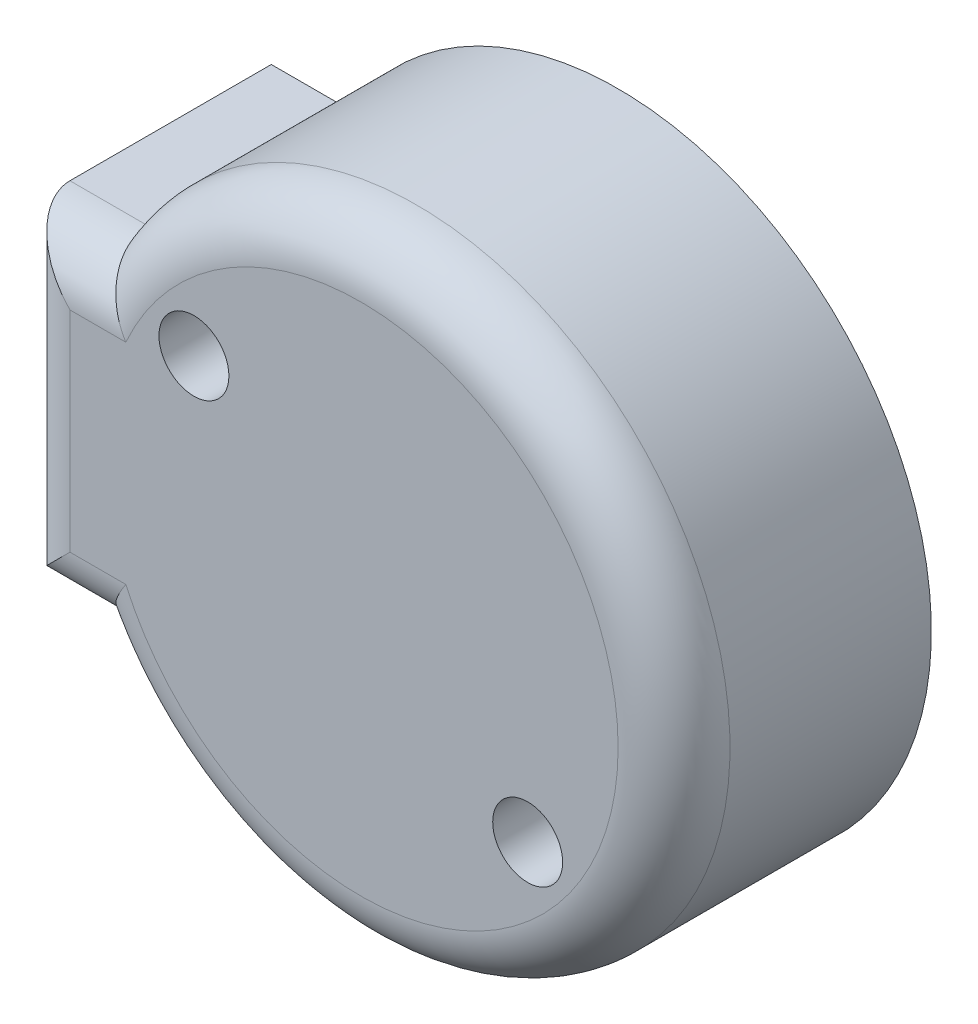
ISO-10303-21;
HEADER;
FILE_DESCRIPTION(('STEP AP214'),'2;1');
FILE_NAME('part.step','',(''),(''),'','','');
FILE_SCHEMA(('AUTOMOTIVE_DESIGN { 1 0 10303 214 1 1 1 1 }'));
ENDSEC;
DATA;
#1=APPLICATION_CONTEXT('core data for automotive mechanical design processes');
#2=APPLICATION_PROTOCOL_DEFINITION('international standard','automotive_design',2000,#1);
#3=PRODUCT_CONTEXT('',#1,'mechanical');
#4=PRODUCT('Part','Part','',(#3));
#5=PRODUCT_RELATED_PRODUCT_CATEGORY('part','',(#4));
#6=PRODUCT_DEFINITION_FORMATION('','',#4);
#7=PRODUCT_DEFINITION_CONTEXT('part definition',#1,'design');
#8=PRODUCT_DEFINITION('design','',#6,#7);
#9=PRODUCT_DEFINITION_SHAPE('','',#8);
#10=(LENGTH_UNIT() NAMED_UNIT(*) SI_UNIT(.MILLI.,.METRE.));
#11=(NAMED_UNIT(*) PLANE_ANGLE_UNIT() SI_UNIT($,.RADIAN.));
#12=(NAMED_UNIT(*) SI_UNIT($,.STERADIAN.) SOLID_ANGLE_UNIT());
#13=UNCERTAINTY_MEASURE_WITH_UNIT(LENGTH_MEASURE(1.E-05),#10,'distance_accuracy_value','');
#14=(GEOMETRIC_REPRESENTATION_CONTEXT(3) GLOBAL_UNCERTAINTY_ASSIGNED_CONTEXT((#13)) GLOBAL_UNIT_ASSIGNED_CONTEXT((#10,
#11,#12)) REPRESENTATION_CONTEXT('',''));
#15=CARTESIAN_POINT('',(0.,0.,0.));
#16=DIRECTION('',(0.,0.,1.));
#17=DIRECTION('',(1.,0.,0.));
#18=AXIS2_PLACEMENT_3D('',#15,#16,#17);
#19=CARTESIAN_POINT('',(0.,0.,11.684));
#20=DIRECTION('',(0.,0.,-1.));
#21=DIRECTION('',(-1.,0.,0.));
#22=AXIS2_PLACEMENT_3D('',#19,#20,#21);
#23=CYLINDRICAL_SURFACE('',#22,14.224);
#24=DIRECTION('',(0.,0.,-1.));
#25=VECTOR('',#24,1.);
#26=CARTESIAN_POINT('',(-12.2063782404938,7.3025,11.684));
#27=LINE('',#26,#25);
#28=CARTESIAN_POINT('',(-12.2063782404938,7.3025,0.));
#29=VERTEX_POINT('',#28);
#30=CARTESIAN_POINT('',(-12.2063782404938,7.3025,9.144));
#31=VERTEX_POINT('',#30);
#32=EDGE_CURVE('E115',#29,#31,#27,.F.);
#33=ORIENTED_EDGE('',*,*,#32,.T.);
#34=CARTESIAN_POINT('',(0.,0.,9.144));
#35=DIRECTION('',(0.,0.,1.));
#36=DIRECTION('',(1.,0.,0.));
#37=AXIS2_PLACEMENT_3D('',#34,#35,#36);
#38=CIRCLE('',#37,14.224);
#39=CARTESIAN_POINT('',(-12.2063782404938,-7.3025,9.144));
#40=VERTEX_POINT('',#39);
#41=EDGE_CURVE('E11',#31,#40,#38,.F.);
#42=ORIENTED_EDGE('',*,*,#41,.T.);
#43=DIRECTION('',(0.,0.,-1.));
#44=VECTOR('',#43,1.);
#45=CARTESIAN_POINT('',(-12.2063782404938,-7.3025,11.684));
#46=LINE('',#45,#44);
#47=CARTESIAN_POINT('',(-12.2063782404938,-7.3025,0.));
#48=VERTEX_POINT('',#47);
#49=EDGE_CURVE('E98',#40,#48,#46,.T.);
#50=ORIENTED_EDGE('',*,*,#49,.T.);
#51=CARTESIAN_POINT('',(0.,0.,0.));
#52=DIRECTION('',(0.,0.,1.));
#53=DIRECTION('',(1.,0.,0.));
#54=AXIS2_PLACEMENT_3D('',#51,#52,#53);
#55=CIRCLE('',#54,14.224);
#56=EDGE_CURVE('E94',#48,#29,#55,.T.);
#57=ORIENTED_EDGE('',*,*,#56,.T.);
#58=EDGE_LOOP('',(#33,#42,#50,#57));
#59=FACE_BOUND('',#58,.T.);
#60=ADVANCED_FACE('F32',(#59),#23,.T.);
#61=CARTESIAN_POINT('',(0.,0.,11.684));
#62=DIRECTION('',(0.,0.,1.));
#63=DIRECTION('',(1.,0.,0.));
#64=AXIS2_PLACEMENT_3D('',#61,#62,#63);
#65=PLANE('',#64);
#66=CARTESIAN_POINT('',(-7.57688490514292,5.77203951253085,11.684));
#67=DIRECTION('',(0.,0.,1.));
#68=DIRECTION('',(1.,0.,0.));
#69=AXIS2_PLACEMENT_3D('',#66,#67,#68);
#70=CIRCLE('',#69,1.5875);
#71=CARTESIAN_POINT('',(-5.98938490514292,5.77203951253085,11.684));
#72=VERTEX_POINT('',#71);
#73=EDGE_CURVE('E139',#72,#72,#70,.F.);
#74=ORIENTED_EDGE('',*,*,#73,.T.);
#75=EDGE_LOOP('',(#74));
#76=FACE_BOUND('',#75,.T.);
#77=CARTESIAN_POINT('',(7.57688490514292,-5.77203951253086,11.684));
#78=DIRECTION('',(0.,0.,1.));
#79=DIRECTION('',(1.,0.,0.));
#80=AXIS2_PLACEMENT_3D('',#77,#78,#79);
#81=CIRCLE('',#80,1.5875);
#82=CARTESIAN_POINT('',(9.16438490514292,-5.77203951253086,11.684));
#83=VERTEX_POINT('',#82);
#84=EDGE_CURVE('E172',#83,#83,#81,.F.);
#85=ORIENTED_EDGE('',*,*,#84,.T.);
#86=EDGE_LOOP('',(#85));
#87=FACE_BOUND('',#86,.T.);
#88=DIRECTION('',(0.,-1.,0.));
#89=VECTOR('',#88,1.);
#90=CARTESIAN_POINT('',(-13.208,0.,11.684));
#91=LINE('',#90,#89);
#92=CARTESIAN_POINT('',(-13.208,4.7625,11.684));
#93=VERTEX_POINT('',#92);
#94=CARTESIAN_POINT('',(-13.208,-4.7625,11.684));
#95=VERTEX_POINT('',#94);
#96=EDGE_CURVE('E122',#93,#95,#91,.T.);
#97=ORIENTED_EDGE('',*,*,#96,.T.);
#98=DIRECTION('',(1.,0.,0.));
#99=VECTOR('',#98,1.);
#100=CARTESIAN_POINT('',(0.,-4.7625,11.684));
#101=LINE('',#100,#99);
#102=CARTESIAN_POINT('',(-10.6693228346508,-4.7625,11.684));
#103=VERTEX_POINT('',#102);
#104=EDGE_CURVE('E124',#95,#103,#101,.T.);
#105=ORIENTED_EDGE('',*,*,#104,.T.);
#106=CARTESIAN_POINT('',(0.,0.,11.684));
#107=DIRECTION('',(0.,0.,1.));
#108=DIRECTION('',(1.,0.,0.));
#109=AXIS2_PLACEMENT_3D('',#106,#107,#108);
#110=CIRCLE('',#109,11.684);
#111=CARTESIAN_POINT('',(-10.6693228346508,4.7625,11.684));
#112=VERTEX_POINT('',#111);
#113=EDGE_CURVE('E118',#103,#112,#110,.T.);
#114=ORIENTED_EDGE('',*,*,#113,.T.);
#115=DIRECTION('',(-1.,0.,0.));
#116=VECTOR('',#115,1.);
#117=CARTESIAN_POINT('',(0.,4.7625,11.684));
#118=LINE('',#117,#116);
#119=EDGE_CURVE('E120',#112,#93,#118,.T.);
#120=ORIENTED_EDGE('',*,*,#119,.T.);
#121=EDGE_LOOP('',(#97,#105,#114,#120));
#122=FACE_BOUND('',#121,.T.);
#123=ADVANCED_FACE('F189',(#76,#87,#122),#65,.T.);
#124=CARTESIAN_POINT('',(0.,0.,0.));
#125=DIRECTION('',(0.,0.,1.));
#126=DIRECTION('',(1.,0.,0.));
#127=AXIS2_PLACEMENT_3D('',#124,#125,#126);
#128=PLANE('',#127);
#129=CARTESIAN_POINT('',(-7.57688490514292,5.77203951253085,0.));
#130=DIRECTION('',(0.,0.,-1.));
#131=DIRECTION('',(-1.,0.,0.));
#132=AXIS2_PLACEMENT_3D('',#129,#130,#131);
#133=CIRCLE('',#132,1.5875);
#134=CARTESIAN_POINT('',(-9.16438490514292,5.77203951253085,0.));
#135=VERTEX_POINT('',#134);
#136=EDGE_CURVE('E175',#135,#135,#133,.T.);
#137=ORIENTED_EDGE('',*,*,#136,.F.);
#138=EDGE_LOOP('',(#137));
#139=FACE_BOUND('',#138,.T.);
#140=CARTESIAN_POINT('',(7.57688490514292,-5.77203951253086,0.));
#141=DIRECTION('',(0.,0.,-1.));
#142=DIRECTION('',(-1.,0.,0.));
#143=AXIS2_PLACEMENT_3D('',#140,#141,#142);
#144=CIRCLE('',#143,1.5875);
#145=CARTESIAN_POINT('',(5.98938490514292,-5.77203951253086,0.));
#146=VERTEX_POINT('',#145);
#147=EDGE_CURVE('E176',#146,#146,#144,.T.);
#148=ORIENTED_EDGE('',*,*,#147,.F.);
#149=EDGE_LOOP('',(#148));
#150=FACE_BOUND('',#149,.T.);
#151=ORIENTED_EDGE('',*,*,#56,.F.);
#152=DIRECTION('',(-1.,0.,0.));
#153=VECTOR('',#152,1.);
#154=CARTESIAN_POINT('',(-15.748,-7.3025,0.));
#155=LINE('',#154,#153);
#156=CARTESIAN_POINT('',(-15.748,-7.3025,0.));
#157=VERTEX_POINT('',#156);
#158=EDGE_CURVE('E88',#48,#157,#155,.T.);
#159=ORIENTED_EDGE('',*,*,#158,.T.);
#160=DIRECTION('',(0.,1.,0.));
#161=VECTOR('',#160,1.);
#162=CARTESIAN_POINT('',(-15.748,7.3025,0.));
#163=LINE('',#162,#161);
#164=CARTESIAN_POINT('',(-15.748,7.3025,0.));
#165=VERTEX_POINT('',#164);
#166=EDGE_CURVE('E92',#157,#165,#163,.T.);
#167=ORIENTED_EDGE('',*,*,#166,.T.);
#168=DIRECTION('',(1.,0.,0.));
#169=VECTOR('',#168,1.);
#170=CARTESIAN_POINT('',(-15.748,7.3025,0.));
#171=LINE('',#170,#169);
#172=EDGE_CURVE('E103',#165,#29,#171,.T.);
#173=ORIENTED_EDGE('',*,*,#172,.T.);
#174=EDGE_LOOP('',(#151,#159,#167,#173));
#175=FACE_BOUND('',#174,.T.);
#176=ADVANCED_FACE('F90',(#139,#150,#175),#128,.F.);
#177=CARTESIAN_POINT('',(-15.748,7.3025,-18.2016148109216));
#178=DIRECTION('',(0.,1.,0.));
#179=DIRECTION('',(0.,0.,1.));
#180=AXIS2_PLACEMENT_3D('',#177,#178,#179);
#181=PLANE('',#180);
#182=DIRECTION('',(0.,0.,1.));
#183=VECTOR('',#182,1.);
#184=CARTESIAN_POINT('',(-15.748,7.3025,-18.2016148109216));
#185=LINE('',#184,#183);
#186=CARTESIAN_POINT('',(-15.748,7.3025,9.14399999999999));
#187=VERTEX_POINT('',#186);
#188=EDGE_CURVE('E102',#165,#187,#185,.T.);
#189=ORIENTED_EDGE('',*,*,#188,.T.);
#190=DIRECTION('',(-1.,0.,0.));
#191=VECTOR('',#190,1.);
#192=CARTESIAN_POINT('',(-15.748,7.3025,9.144));
#193=LINE('',#192,#191);
#194=EDGE_CURVE('E41',#187,#31,#193,.F.);
#195=ORIENTED_EDGE('',*,*,#194,.T.);
#196=ORIENTED_EDGE('',*,*,#32,.F.);
#197=ORIENTED_EDGE('',*,*,#172,.F.);
#198=EDGE_LOOP('',(#189,#195,#196,#197));
#199=FACE_BOUND('',#198,.T.);
#200=ADVANCED_FACE('F169',(#199),#181,.T.);
#201=CARTESIAN_POINT('',(-15.748,-7.3025,-18.2016148109216));
#202=DIRECTION('',(0.,-1.,0.));
#203=DIRECTION('',(0.,0.,-1.));
#204=AXIS2_PLACEMENT_3D('',#201,#202,#203);
#205=PLANE('',#204);
#206=ORIENTED_EDGE('',*,*,#49,.F.);
#207=DIRECTION('',(1.,0.,0.));
#208=VECTOR('',#207,1.);
#209=CARTESIAN_POINT('',(-15.748,-7.3025,9.144));
#210=LINE('',#209,#208);
#211=CARTESIAN_POINT('',(-15.748,-7.3025,9.14399999999999));
#212=VERTEX_POINT('',#211);
#213=EDGE_CURVE('E108',#40,#212,#210,.F.);
#214=ORIENTED_EDGE('',*,*,#213,.T.);
#215=DIRECTION('',(0.,0.,1.));
#216=VECTOR('',#215,1.);
#217=CARTESIAN_POINT('',(-15.748,-7.3025,-18.2016148109216));
#218=LINE('',#217,#216);
#219=EDGE_CURVE('E101',#157,#212,#218,.T.);
#220=ORIENTED_EDGE('',*,*,#219,.F.);
#221=ORIENTED_EDGE('',*,*,#158,.F.);
#222=EDGE_LOOP('',(#206,#214,#220,#221));
#223=FACE_BOUND('',#222,.T.);
#224=ADVANCED_FACE('F106',(#223),#205,.T.);
#225=CARTESIAN_POINT('',(-15.748,7.3025,-18.2016148109216));
#226=DIRECTION('',(-1.,0.,0.));
#227=DIRECTION('',(0.,0.,1.));
#228=AXIS2_PLACEMENT_3D('',#225,#226,#227);
#229=PLANE('',#228);
#230=ORIENTED_EDGE('',*,*,#219,.T.);
#231=DIRECTION('',(0.,-1.,0.));
#232=VECTOR('',#231,1.);
#233=CARTESIAN_POINT('',(-15.748,7.3025,9.144));
#234=LINE('',#233,#232);
#235=EDGE_CURVE('E56',#212,#187,#234,.F.);
#236=ORIENTED_EDGE('',*,*,#235,.T.);
#237=ORIENTED_EDGE('',*,*,#188,.F.);
#238=ORIENTED_EDGE('',*,*,#166,.F.);
#239=EDGE_LOOP('',(#230,#236,#237,#238));
#240=FACE_BOUND('',#239,.T.);
#241=ADVANCED_FACE('F100',(#240),#229,.T.);
#242=CARTESIAN_POINT('',(0.,4.7625,9.144));
#243=DIRECTION('',(-1.,0.,0.));
#244=DIRECTION('',(0.,0.,1.));
#245=AXIS2_PLACEMENT_3D('',#242,#243,#244);
#246=CYLINDRICAL_SURFACE('',#245,2.54);
#247=CARTESIAN_POINT('',(-12.2063782404938,7.3025,9.144));
#248=CARTESIAN_POINT('',(-12.2063833765361,7.30251081629843,9.20860770756605));
#249=CARTESIAN_POINT('',(-12.2049805851282,7.30003521513991,9.27320953147759));
#250=CARTESIAN_POINT('',(-12.1993987873526,7.29019390975039,9.40190017036242));
#251=CARTESIAN_POINT('',(-12.1952206079676,7.28282966219015,9.46598913239787));
#252=CARTESIAN_POINT('',(-12.1841493688148,7.26333198815409,9.59294259577827));
#253=CARTESIAN_POINT('',(-12.1772670135071,7.2512173663771,9.65581091164732));
#254=CARTESIAN_POINT('',(-12.1608676394844,7.22238479304907,9.78011620632616));
#255=CARTESIAN_POINT('',(-12.15135052612,7.20566667612517,9.8415531336297));
#256=CARTESIAN_POINT('',(-12.1189967105256,7.14891629740216,10.0229897657637));
#257=CARTESIAN_POINT('',(-12.0923389608859,7.10225511055377,10.1403248119491));
#258=CARTESIAN_POINT('',(-12.0298489863483,6.99336369932156,10.3648454021488));
#259=CARTESIAN_POINT('',(-11.9940101563639,6.93112226688021,10.4720235626916));
#260=CARTESIAN_POINT('',(-11.9124583563322,6.79027427562904,10.678962240616));
#261=CARTESIAN_POINT('',(-11.866362535423,6.71103938648053,10.7781429064421));
#262=CARTESIAN_POINT('',(-11.7667788916754,6.54102753212032,10.9617221247867));
#263=CARTESIAN_POINT('',(-11.7132893738305,6.45024792066151,11.0461172776352));
#264=CARTESIAN_POINT('',(-11.5933219031135,6.24820741695659,11.2087205144632));
#265=CARTESIAN_POINT('',(-11.5260554980578,6.13579894280917,11.2849181104718));
#266=CARTESIAN_POINT('',(-11.3855121958088,5.90318412353233,11.4174096072657));
#267=CARTESIAN_POINT('',(-11.3122286096649,5.7829691322507,11.4736809778768));
#268=CARTESIAN_POINT('',(-11.1477296439593,5.51591470024551,11.574600980046));
#269=CARTESIAN_POINT('',(-11.0556477219521,5.36815173498054,11.6153847083596));
#270=CARTESIAN_POINT('',(-10.8676592168761,5.07043593031911,11.6697902653141));
#271=CARTESIAN_POINT('',(-10.7717603982454,4.92048789410155,11.6834646218654));
#272=CARTESIAN_POINT('',(-10.6731495417006,4.7683995622048,11.6839948686613));
#273=CARTESIAN_POINT('',(-10.6712363399099,4.76544961470523,11.6840000068502));
#274=CARTESIAN_POINT('',(-10.6693228346508,4.7625,11.684));
#275=B_SPLINE_CURVE_WITH_KNOTS('',3,(#247,#248,#249,#250,#251,#252,#253,#254,#255,#256,#257,
#258,#259,#260,#261,#262,#263,#264,#265,#266,#267,#268,#269,#270,#271,#272,#273,#274),
.UNSPECIFIED.,.F.,.F.,(4,2,2,2,2,2,2,2,2,2,2,2,2,4),(0.,0.193750595615582,0.387443485232802,
0.580377244968128,0.773317936430625,1.15856885357873,1.54409771154427,1.94762421512522,
2.3512433811369,2.80409697276204,3.25746097389573,3.79171201234433,4.32492685467048,
4.3354749650833),.UNSPECIFIED.);
#276=EDGE_CURVE('E112',#31,#112,#275,.T.);
#277=ORIENTED_EDGE('',*,*,#276,.F.);
#278=ORIENTED_EDGE('',*,*,#194,.F.);
#279=CARTESIAN_POINT('',(-13.208,4.7625,9.144));
#280=DIRECTION('',(-0.707106781186547,-0.707106781186547,0.));
#281=DIRECTION('',(-0.707106781186547,0.707106781186547,0.));
#282=AXIS2_PLACEMENT_3D('',#279,#280,#281);
#283=ELLIPSE('',#282,3.59210244842766,2.54);
#284=EDGE_CURVE('E36',#93,#187,#283,.T.);
#285=ORIENTED_EDGE('',*,*,#284,.F.);
#286=ORIENTED_EDGE('',*,*,#119,.F.);
#287=EDGE_LOOP('',(#277,#278,#285,#286));
#288=FACE_BOUND('',#287,.T.);
#289=ADVANCED_FACE('F148',(#288),#246,.T.);
#290=CARTESIAN_POINT('',(-13.208,0.,9.144));
#291=DIRECTION('',(0.,-1.,0.));
#292=DIRECTION('',(0.,0.,-1.));
#293=AXIS2_PLACEMENT_3D('',#290,#291,#292);
#294=CYLINDRICAL_SURFACE('',#293,2.54);
#295=ORIENTED_EDGE('',*,*,#284,.T.);
#296=ORIENTED_EDGE('',*,*,#235,.F.);
#297=CARTESIAN_POINT('',(-13.208,-4.7625,9.144));
#298=DIRECTION('',(0.707106781186547,-0.707106781186547,0.));
#299=DIRECTION('',(-0.707106781186547,-0.707106781186547,0.));
#300=AXIS2_PLACEMENT_3D('',#297,#298,#299);
#301=ELLIPSE('',#300,3.59210244842766,2.54);
#302=EDGE_CURVE('E138',#95,#212,#301,.T.);
#303=ORIENTED_EDGE('',*,*,#302,.F.);
#304=ORIENTED_EDGE('',*,*,#96,.F.);
#305=EDGE_LOOP('',(#295,#296,#303,#304));
#306=FACE_BOUND('',#305,.T.);
#307=ADVANCED_FACE('F34',(#306),#294,.T.);
#308=CARTESIAN_POINT('',(0.,0.,9.144));
#309=DIRECTION('',(0.,0.,1.));
#310=DIRECTION('',(1.,0.,0.));
#311=AXIS2_PLACEMENT_3D('',#308,#309,#310);
#312=TOROIDAL_SURFACE('',#311,11.684,2.54);
#313=ORIENTED_EDGE('',*,*,#276,.T.);
#314=ORIENTED_EDGE('',*,*,#113,.F.);
#315=CARTESIAN_POINT('',(-12.2063782404938,-7.3025,9.144));
#316=CARTESIAN_POINT('',(-12.2063833765361,-7.30251081629843,9.20860770756605));
#317=CARTESIAN_POINT('',(-12.2049805851282,-7.30003521513991,9.27320953147759));
#318=CARTESIAN_POINT('',(-12.1993987873526,-7.29019390975039,9.40190017036242));
#319=CARTESIAN_POINT('',(-12.1952206079676,-7.28282966219015,9.46598913239787));
#320=CARTESIAN_POINT('',(-12.1841493688148,-7.26333198815409,9.59294259577827));
#321=CARTESIAN_POINT('',(-12.1772670135071,-7.2512173663771,9.65581091164732));
#322=CARTESIAN_POINT('',(-12.1608676394844,-7.22238479304907,9.78011620632616));
#323=CARTESIAN_POINT('',(-12.15135052612,-7.20566667612517,9.8415531336297));
#324=CARTESIAN_POINT('',(-12.1189967105256,-7.14891629740216,10.0229897657637));
#325=CARTESIAN_POINT('',(-12.0923389608859,-7.10225511055377,10.1403248119491));
#326=CARTESIAN_POINT('',(-12.0298489863483,-6.99336369932156,10.3648454021488));
#327=CARTESIAN_POINT('',(-11.9940101563639,-6.93112226688021,10.4720235626916));
#328=CARTESIAN_POINT('',(-11.9124583563322,-6.79027427562904,10.678962240616));
#329=CARTESIAN_POINT('',(-11.866362535423,-6.71103938648053,10.7781429064421));
#330=CARTESIAN_POINT('',(-11.7667788916754,-6.54102753212032,10.9617221247867));
#331=CARTESIAN_POINT('',(-11.7132893738305,-6.45024792066151,11.0461172776352));
#332=CARTESIAN_POINT('',(-11.5933219031135,-6.24820741695659,11.2087205144632));
#333=CARTESIAN_POINT('',(-11.5260554980578,-6.13579894280917,11.2849181104718));
#334=CARTESIAN_POINT('',(-11.3855121958088,-5.90318412353233,11.4174096072657));
#335=CARTESIAN_POINT('',(-11.3122286096649,-5.7829691322507,11.4736809778768));
#336=CARTESIAN_POINT('',(-11.1477296439593,-5.51591470024551,11.574600980046));
#337=CARTESIAN_POINT('',(-11.0556477219521,-5.36815173498054,11.6153847083596));
#338=CARTESIAN_POINT('',(-10.8676592168761,-5.07043593031911,11.6697902653141));
#339=CARTESIAN_POINT('',(-10.7717603982454,-4.92048789410155,11.6834646218654));
#340=CARTESIAN_POINT('',(-10.6731495417006,-4.7683995622048,11.6839948686613));
#341=CARTESIAN_POINT('',(-10.6712363399099,-4.76544961470523,11.6840000068502));
#342=CARTESIAN_POINT('',(-10.6693228346508,-4.7625,11.684));
#343=B_SPLINE_CURVE_WITH_KNOTS('',3,(#315,#316,#317,#318,#319,#320,#321,#322,#323,#324,#325,
#326,#327,#328,#329,#330,#331,#332,#333,#334,#335,#336,#337,#338,#339,#340,#341,#342),
.UNSPECIFIED.,.F.,.F.,(4,2,2,2,2,2,2,2,2,2,2,2,2,4),(0.,0.193750595615582,0.387443485232802,
0.580377244968128,0.773317936430625,1.15856885357873,1.54409771154427,1.94762421512522,
2.3512433811369,2.80409697276204,3.25746097389573,3.79171201234433,4.32492685467048,
4.3354749650833),.UNSPECIFIED.);
#344=EDGE_CURVE('E130',#40,#103,#343,.T.);
#345=ORIENTED_EDGE('',*,*,#344,.F.);
#346=ORIENTED_EDGE('',*,*,#41,.F.);
#347=EDGE_LOOP('',(#313,#314,#345,#346));
#348=FACE_BOUND('',#347,.T.);
#349=ADVANCED_FACE('F140',(#348),#312,.T.);
#350=CARTESIAN_POINT('',(0.,-4.7625,9.144));
#351=DIRECTION('',(1.,0.,0.));
#352=DIRECTION('',(0.,0.,-1.));
#353=AXIS2_PLACEMENT_3D('',#350,#351,#352);
#354=CYLINDRICAL_SURFACE('',#353,2.54);
#355=ORIENTED_EDGE('',*,*,#302,.T.);
#356=ORIENTED_EDGE('',*,*,#213,.F.);
#357=ORIENTED_EDGE('',*,*,#344,.T.);
#358=ORIENTED_EDGE('',*,*,#104,.F.);
#359=EDGE_LOOP('',(#355,#356,#357,#358));
#360=FACE_BOUND('',#359,.T.);
#361=ADVANCED_FACE('F143',(#360),#354,.T.);
#362=CARTESIAN_POINT('',(7.57688490514292,-5.77203951253086,16.1741280605346));
#363=DIRECTION('',(0.,0.,-1.));
#364=DIRECTION('',(-1.,0.,0.));
#365=AXIS2_PLACEMENT_3D('',#362,#363,#364);
#366=CYLINDRICAL_SURFACE('',#365,1.5875);
#367=ORIENTED_EDGE('',*,*,#147,.T.);
#368=EDGE_LOOP('',(#367));
#369=FACE_BOUND('',#368,.T.);
#370=ORIENTED_EDGE('',*,*,#84,.F.);
#371=EDGE_LOOP('',(#370));
#372=FACE_BOUND('',#371,.T.);
#373=ADVANCED_FACE('F146',(#369,#372),#366,.F.);
#374=CARTESIAN_POINT('',(-7.57688490514292,5.77203951253085,16.1741280605346));
#375=DIRECTION('',(0.,0.,-1.));
#376=DIRECTION('',(-1.,0.,0.));
#377=AXIS2_PLACEMENT_3D('',#374,#375,#376);
#378=CYLINDRICAL_SURFACE('',#377,1.5875);
#379=ORIENTED_EDGE('',*,*,#136,.T.);
#380=EDGE_LOOP('',(#379));
#381=FACE_BOUND('',#380,.T.);
#382=ORIENTED_EDGE('',*,*,#73,.F.);
#383=EDGE_LOOP('',(#382));
#384=FACE_BOUND('',#383,.T.);
#385=ADVANCED_FACE('F184',(#381,#384),#378,.F.);
#386=CLOSED_SHELL('',(#60,#123,#176,#200,#224,#241,#289,#307,#349,#361,#373,#385));
#387=MANIFOLD_SOLID_BREP('B2',#386);
#388=ADVANCED_BREP_SHAPE_REPRESENTATION('',(#18,#387),#14);
#389=SHAPE_DEFINITION_REPRESENTATION(#9,#388);
ENDSEC;
END-ISO-10303-21;
